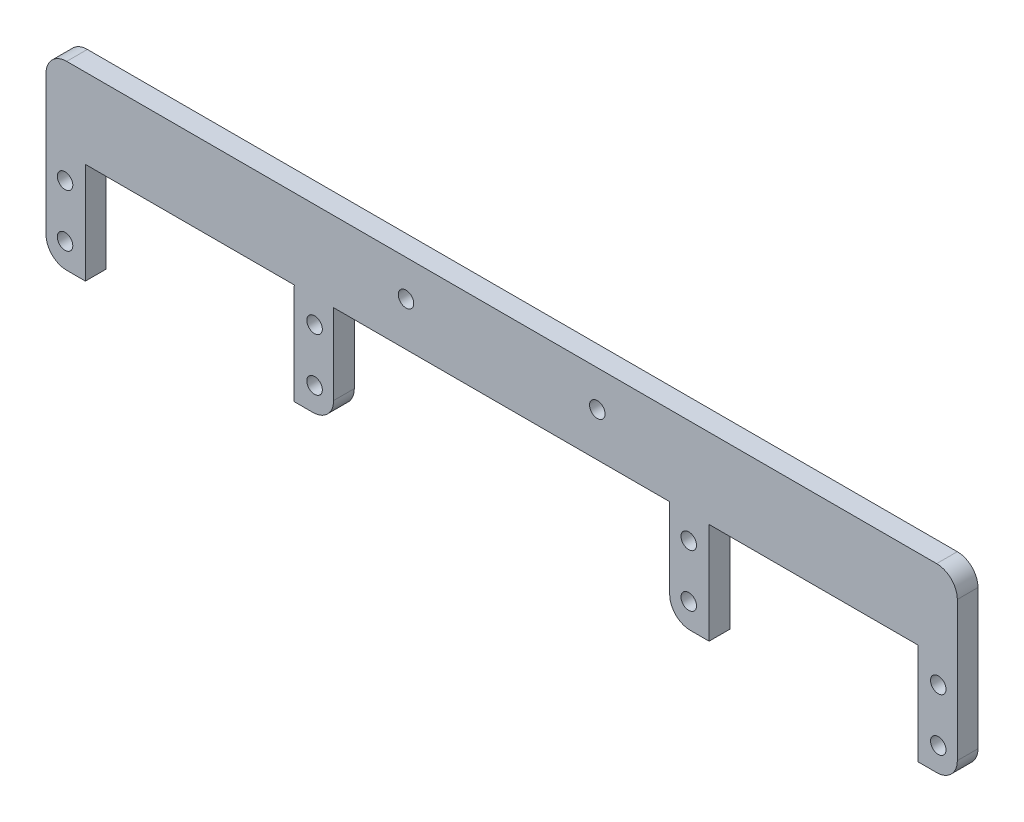
ISO-10303-21;
HEADER;
FILE_DESCRIPTION(('STEP AP214'),'2;1');
FILE_NAME('part.step','',(''),(''),'','','');
FILE_SCHEMA(('AUTOMOTIVE_DESIGN { 1 0 10303 214 1 1 1 1 }'));
ENDSEC;
DATA;
#1=APPLICATION_CONTEXT('core data for automotive mechanical design processes');
#2=APPLICATION_PROTOCOL_DEFINITION('international standard','automotive_design',2000,#1);
#3=PRODUCT_CONTEXT('',#1,'mechanical');
#4=PRODUCT('Part','Part','',(#3));
#5=PRODUCT_RELATED_PRODUCT_CATEGORY('part','',(#4));
#6=PRODUCT_DEFINITION_FORMATION('','',#4);
#7=PRODUCT_DEFINITION_CONTEXT('part definition',#1,'design');
#8=PRODUCT_DEFINITION('design','',#6,#7);
#9=PRODUCT_DEFINITION_SHAPE('','',#8);
#10=(LENGTH_UNIT() NAMED_UNIT(*) SI_UNIT(.MILLI.,.METRE.));
#11=(NAMED_UNIT(*) PLANE_ANGLE_UNIT() SI_UNIT($,.RADIAN.));
#12=(NAMED_UNIT(*) SI_UNIT($,.STERADIAN.) SOLID_ANGLE_UNIT());
#13=UNCERTAINTY_MEASURE_WITH_UNIT(LENGTH_MEASURE(1.E-05),#10,'distance_accuracy_value','');
#14=(GEOMETRIC_REPRESENTATION_CONTEXT(3) GLOBAL_UNCERTAINTY_ASSIGNED_CONTEXT((#13)) GLOBAL_UNIT_ASSIGNED_CONTEXT((#10,
#11,#12)) REPRESENTATION_CONTEXT('',''));
#15=CARTESIAN_POINT('',(0.,0.,0.));
#16=DIRECTION('',(0.,0.,1.));
#17=DIRECTION('',(1.,0.,0.));
#18=AXIS2_PLACEMENT_3D('',#15,#16,#17);
#19=CARTESIAN_POINT('',(0.,32.3655253772291,4.));
#20=DIRECTION('',(0.,1.,0.));
#21=DIRECTION('',(0.,0.,1.));
#22=AXIS2_PLACEMENT_3D('',#19,#20,#21);
#23=PLANE('',#22);
#24=DIRECTION('',(1.,0.,0.));
#25=VECTOR('',#24,1.);
#26=CARTESIAN_POINT('',(0.,32.3655253772291,0.));
#27=LINE('',#26,#25);
#28=CARTESIAN_POINT('',(-211.327093968146,32.3655253772291,0.));
#29=VERTEX_POINT('',#28);
#30=CARTESIAN_POINT('',(-43.0750939681456,32.3655253772291,0.));
#31=VERTEX_POINT('',#30);
#32=EDGE_CURVE('E258',#29,#31,#27,.T.);
#33=ORIENTED_EDGE('',*,*,#32,.F.);
#34=DIRECTION('',(0.,0.,-1.));
#35=VECTOR('',#34,1.);
#36=CARTESIAN_POINT('',(-211.327093968146,32.3655253772291,4.));
#37=LINE('',#36,#35);
#38=CARTESIAN_POINT('',(-211.327093968146,32.3655253772291,4.));
#39=VERTEX_POINT('',#38);
#40=EDGE_CURVE('E11',#29,#39,#37,.F.);
#41=ORIENTED_EDGE('',*,*,#40,.T.);
#42=DIRECTION('',(1.,0.,0.));
#43=VECTOR('',#42,1.);
#44=CARTESIAN_POINT('',(0.,32.3655253772291,4.));
#45=LINE('',#44,#43);
#46=CARTESIAN_POINT('',(-43.0750939681456,32.3655253772291,4.));
#47=VERTEX_POINT('',#46);
#48=EDGE_CURVE('E303',#39,#47,#45,.T.);
#49=ORIENTED_EDGE('',*,*,#48,.T.);
#50=DIRECTION('',(0.,0.,-1.));
#51=VECTOR('',#50,1.);
#52=CARTESIAN_POINT('',(-43.0750939681456,32.3655253772291,0.));
#53=LINE('',#52,#51);
#54=EDGE_CURVE('E42',#47,#31,#53,.T.);
#55=ORIENTED_EDGE('',*,*,#54,.T.);
#56=EDGE_LOOP('',(#33,#41,#49,#55));
#57=FACE_BOUND('',#56,.T.);
#58=ADVANCED_FACE('F34',(#57),#23,.T.);
#59=CARTESIAN_POINT('',(-215.327093968146,0.,4.));
#60=DIRECTION('',(-1.,0.,0.));
#61=DIRECTION('',(0.,0.,1.));
#62=AXIS2_PLACEMENT_3D('',#59,#60,#61);
#63=PLANE('',#62);
#64=DIRECTION('',(0.,1.,0.));
#65=VECTOR('',#64,1.);
#66=CARTESIAN_POINT('',(-215.327093968146,0.,0.));
#67=LINE('',#66,#65);
#68=CARTESIAN_POINT('',(-215.327093968146,1.36552537722908,0.));
#69=VERTEX_POINT('',#68);
#70=CARTESIAN_POINT('',(-215.327093968146,28.3655253772291,0.));
#71=VERTEX_POINT('',#70);
#72=EDGE_CURVE('E261',#69,#71,#67,.T.);
#73=ORIENTED_EDGE('',*,*,#72,.F.);
#74=DIRECTION('',(0.,0.,-1.));
#75=VECTOR('',#74,1.);
#76=CARTESIAN_POINT('',(-215.327093968146,1.36552537722908,4.));
#77=LINE('',#76,#75);
#78=CARTESIAN_POINT('',(-215.327093968146,1.36552537722908,4.));
#79=VERTEX_POINT('',#78);
#80=EDGE_CURVE('E366',#69,#79,#77,.F.);
#81=ORIENTED_EDGE('',*,*,#80,.T.);
#82=DIRECTION('',(0.,1.,0.));
#83=VECTOR('',#82,1.);
#84=CARTESIAN_POINT('',(-215.327093968146,0.,4.));
#85=LINE('',#84,#83);
#86=CARTESIAN_POINT('',(-215.327093968146,28.3655253772291,4.));
#87=VERTEX_POINT('',#86);
#88=EDGE_CURVE('E220',#79,#87,#85,.T.);
#89=ORIENTED_EDGE('',*,*,#88,.T.);
#90=DIRECTION('',(0.,0.,-1.));
#91=VECTOR('',#90,1.);
#92=CARTESIAN_POINT('',(-215.327093968146,28.3655253772291,4.));
#93=LINE('',#92,#91);
#94=EDGE_CURVE('E363',#87,#71,#93,.T.);
#95=ORIENTED_EDGE('',*,*,#94,.T.);
#96=EDGE_LOOP('',(#73,#81,#89,#95));
#97=FACE_BOUND('',#96,.T.);
#98=ADVANCED_FACE('F393',(#97),#63,.T.);
#99=CARTESIAN_POINT('',(0.,-2.63447462277092,4.));
#100=DIRECTION('',(0.,-1.,0.));
#101=DIRECTION('',(0.,0.,-1.));
#102=AXIS2_PLACEMENT_3D('',#99,#100,#101);
#103=PLANE('',#102);
#104=DIRECTION('',(-1.,0.,0.));
#105=VECTOR('',#104,1.);
#106=CARTESIAN_POINT('',(0.,-2.63447462277092,4.));
#107=LINE('',#106,#105);
#108=CARTESIAN_POINT('',(-207.707093968146,-2.63447462277092,4.));
#109=VERTEX_POINT('',#108);
#110=CARTESIAN_POINT('',(-211.327093968146,-2.63447462277092,4.));
#111=VERTEX_POINT('',#110);
#112=EDGE_CURVE('E200',#109,#111,#107,.T.);
#113=ORIENTED_EDGE('',*,*,#112,.T.);
#114=DIRECTION('',(0.,0.,-1.));
#115=VECTOR('',#114,1.);
#116=CARTESIAN_POINT('',(-211.327093968146,-2.63447462277092,4.));
#117=LINE('',#116,#115);
#118=CARTESIAN_POINT('',(-211.327093968146,-2.63447462277092,0.));
#119=VERTEX_POINT('',#118);
#120=EDGE_CURVE('E361',#111,#119,#117,.T.);
#121=ORIENTED_EDGE('',*,*,#120,.T.);
#122=DIRECTION('',(-1.,0.,0.));
#123=VECTOR('',#122,1.);
#124=CARTESIAN_POINT('',(0.,-2.63447462277092,0.));
#125=LINE('',#124,#123);
#126=CARTESIAN_POINT('',(-207.707093968146,-2.63447462277092,0.));
#127=VERTEX_POINT('',#126);
#128=EDGE_CURVE('E203',#127,#119,#125,.T.);
#129=ORIENTED_EDGE('',*,*,#128,.F.);
#130=DIRECTION('',(0.,0.,-1.));
#131=VECTOR('',#130,1.);
#132=CARTESIAN_POINT('',(-207.707093968146,-2.63447462277092,4.));
#133=LINE('',#132,#131);
#134=EDGE_CURVE('E196',#109,#127,#133,.T.);
#135=ORIENTED_EDGE('',*,*,#134,.F.);
#136=EDGE_LOOP('',(#113,#121,#129,#135));
#137=FACE_BOUND('',#136,.T.);
#138=ADVANCED_FACE('F198',(#137),#103,.T.);
#139=CARTESIAN_POINT('',(-207.707093968146,0.,4.));
#140=DIRECTION('',(1.,0.,0.));
#141=DIRECTION('',(0.,0.,-1.));
#142=AXIS2_PLACEMENT_3D('',#139,#140,#141);
#143=PLANE('',#142);
#144=DIRECTION('',(0.,-1.,0.));
#145=VECTOR('',#144,1.);
#146=CARTESIAN_POINT('',(-207.707093968146,0.,0.));
#147=LINE('',#146,#145);
#148=CARTESIAN_POINT('',(-207.707093968146,16.9235253772291,0.));
#149=VERTEX_POINT('',#148);
#150=EDGE_CURVE('E266',#149,#127,#147,.T.);
#151=ORIENTED_EDGE('',*,*,#150,.F.);
#152=DIRECTION('',(0.,0.,-1.));
#153=VECTOR('',#152,1.);
#154=CARTESIAN_POINT('',(-207.707093968146,16.9235253772291,4.));
#155=LINE('',#154,#153);
#156=CARTESIAN_POINT('',(-207.707093968146,16.9235253772291,4.));
#157=VERTEX_POINT('',#156);
#158=EDGE_CURVE('E209',#157,#149,#155,.T.);
#159=ORIENTED_EDGE('',*,*,#158,.F.);
#160=DIRECTION('',(0.,-1.,0.));
#161=VECTOR('',#160,1.);
#162=CARTESIAN_POINT('',(-207.707093968146,0.,4.));
#163=LINE('',#162,#161);
#164=EDGE_CURVE('E215',#157,#109,#163,.T.);
#165=ORIENTED_EDGE('',*,*,#164,.T.);
#166=ORIENTED_EDGE('',*,*,#134,.T.);
#167=EDGE_LOOP('',(#151,#159,#165,#166));
#168=FACE_BOUND('',#167,.T.);
#169=ADVANCED_FACE('F222',(#168),#143,.T.);
#170=CARTESIAN_POINT('',(0.,16.9235253772291,4.));
#171=DIRECTION('',(0.,-1.,0.));
#172=DIRECTION('',(0.,0.,-1.));
#173=AXIS2_PLACEMENT_3D('',#170,#171,#172);
#174=PLANE('',#173);
#175=DIRECTION('',(-1.,0.,0.));
#176=VECTOR('',#175,1.);
#177=CARTESIAN_POINT('',(0.,16.9235253772291,0.));
#178=LINE('',#177,#176);
#179=CARTESIAN_POINT('',(-167.321093968146,16.9235253772291,0.));
#180=VERTEX_POINT('',#179);
#181=EDGE_CURVE('E268',#180,#149,#178,.T.);
#182=ORIENTED_EDGE('',*,*,#181,.F.);
#183=DIRECTION('',(0.,0.,-1.));
#184=VECTOR('',#183,1.);
#185=CARTESIAN_POINT('',(-167.321093968146,16.9235253772291,4.));
#186=LINE('',#185,#184);
#187=CARTESIAN_POINT('',(-167.321093968146,16.9235253772291,4.));
#188=VERTEX_POINT('',#187);
#189=EDGE_CURVE('E327',#188,#180,#186,.T.);
#190=ORIENTED_EDGE('',*,*,#189,.F.);
#191=DIRECTION('',(-1.,0.,0.));
#192=VECTOR('',#191,1.);
#193=CARTESIAN_POINT('',(0.,16.9235253772291,4.));
#194=LINE('',#193,#192);
#195=EDGE_CURVE('E223',#188,#157,#194,.T.);
#196=ORIENTED_EDGE('',*,*,#195,.T.);
#197=ORIENTED_EDGE('',*,*,#158,.T.);
#198=EDGE_LOOP('',(#182,#190,#196,#197));
#199=FACE_BOUND('',#198,.T.);
#200=ADVANCED_FACE('F827',(#199),#174,.T.);
#201=CARTESIAN_POINT('',(-129.794494110069,-61.8400685254336,4.));
#202=DIRECTION('',(0.9027709537187,0.430121616664205,0.));
#203=DIRECTION('',(-0.430121616664205,0.9027709537187,0.));
#204=AXIS2_PLACEMENT_3D('',#201,#202,#203);
#205=PLANE('',#204);
#206=DIRECTION('',(0.430121616664205,-0.9027709537187,0.));
#207=VECTOR('',#206,1.);
#208=CARTESIAN_POINT('',(-129.794494110069,-61.8400685254336,0.));
#209=LINE('',#208,#207);
#210=CARTESIAN_POINT('',(-167.231910297222,16.7363401148836,0.));
#211=VERTEX_POINT('',#210);
#212=EDGE_CURVE('E271',#180,#211,#209,.T.);
#213=ORIENTED_EDGE('',*,*,#212,.T.);
#214=DIRECTION('',(0.,0.,-1.));
#215=VECTOR('',#214,1.);
#216=CARTESIAN_POINT('',(-167.231910297222,16.7363401148836,4.));
#217=LINE('',#216,#215);
#218=CARTESIAN_POINT('',(-167.231910297222,16.7363401148836,4.));
#219=VERTEX_POINT('',#218);
#220=EDGE_CURVE('E325',#219,#211,#217,.T.);
#221=ORIENTED_EDGE('',*,*,#220,.F.);
#222=DIRECTION('',(0.430121616664205,-0.9027709537187,0.));
#223=VECTOR('',#222,1.);
#224=CARTESIAN_POINT('',(-129.794494110069,-61.8400685254336,4.));
#225=LINE('',#224,#223);
#226=EDGE_CURVE('E225',#188,#219,#225,.T.);
#227=ORIENTED_EDGE('',*,*,#226,.F.);
#228=ORIENTED_EDGE('',*,*,#189,.T.);
#229=EDGE_LOOP('',(#213,#221,#227,#228));
#230=FACE_BOUND('',#229,.T.);
#231=ADVANCED_FACE('F817',(#230),#205,.F.);
#232=CARTESIAN_POINT('',(0.0738221222793477,15.9626026151486,4.));
#233=DIRECTION('',(0.00462464264921358,0.999989306283006,0.));
#234=DIRECTION('',(-0.999989306283006,0.00462464264921358,0.));
#235=AXIS2_PLACEMENT_3D('',#232,#233,#234);
#236=PLANE('',#235);
#237=DIRECTION('',(0.999989306283006,-0.00462464264921357,0.));
#238=VECTOR('',#237,1.);
#239=CARTESIAN_POINT('',(0.0738221222793477,15.9626026151486,0.));
#240=LINE('',#239,#238);
#241=CARTESIAN_POINT('',(-167.321093968146,16.7367525619023,0.));
#242=VERTEX_POINT('',#241);
#243=EDGE_CURVE('E274',#242,#211,#240,.T.);
#244=ORIENTED_EDGE('',*,*,#243,.F.);
#245=DIRECTION('',(0.,0.,-1.));
#246=VECTOR('',#245,1.);
#247=CARTESIAN_POINT('',(-167.321093968146,16.7367525619023,4.));
#248=LINE('',#247,#246);
#249=CARTESIAN_POINT('',(-167.321093968146,16.7367525619023,4.));
#250=VERTEX_POINT('',#249);
#251=EDGE_CURVE('E323',#250,#242,#248,.T.);
#252=ORIENTED_EDGE('',*,*,#251,.F.);
#253=DIRECTION('',(0.999989306283006,-0.00462464264921357,0.));
#254=VECTOR('',#253,1.);
#255=CARTESIAN_POINT('',(0.0738221222793477,15.9626026151486,4.));
#256=LINE('',#255,#254);
#257=EDGE_CURVE('E230',#250,#219,#256,.T.);
#258=ORIENTED_EDGE('',*,*,#257,.T.);
#259=ORIENTED_EDGE('',*,*,#220,.T.);
#260=EDGE_LOOP('',(#244,#252,#258,#259));
#261=FACE_BOUND('',#260,.T.);
#262=ADVANCED_FACE('F807',(#261),#236,.T.);
#263=CARTESIAN_POINT('',(-167.321093968146,0.,4.));
#264=DIRECTION('',(-1.,0.,0.));
#265=DIRECTION('',(0.,0.,1.));
#266=AXIS2_PLACEMENT_3D('',#263,#264,#265);
#267=PLANE('',#266);
#268=DIRECTION('',(0.,1.,0.));
#269=VECTOR('',#268,1.);
#270=CARTESIAN_POINT('',(-167.321093968146,0.,0.));
#271=LINE('',#270,#269);
#272=CARTESIAN_POINT('',(-167.321093968146,-2.63447462277092,0.));
#273=VERTEX_POINT('',#272);
#274=EDGE_CURVE('E277',#273,#242,#271,.T.);
#275=ORIENTED_EDGE('',*,*,#274,.F.);
#276=DIRECTION('',(0.,0.,-1.));
#277=VECTOR('',#276,1.);
#278=CARTESIAN_POINT('',(-167.321093968146,-2.63447462277092,4.));
#279=LINE('',#278,#277);
#280=CARTESIAN_POINT('',(-167.321093968146,-2.63447462277092,4.));
#281=VERTEX_POINT('',#280);
#282=EDGE_CURVE('E320',#281,#273,#279,.T.);
#283=ORIENTED_EDGE('',*,*,#282,.F.);
#284=DIRECTION('',(0.,1.,0.));
#285=VECTOR('',#284,1.);
#286=CARTESIAN_POINT('',(-167.321093968146,0.,4.));
#287=LINE('',#286,#285);
#288=EDGE_CURVE('E233',#281,#250,#287,.T.);
#289=ORIENTED_EDGE('',*,*,#288,.T.);
#290=ORIENTED_EDGE('',*,*,#251,.T.);
#291=EDGE_LOOP('',(#275,#283,#289,#290));
#292=FACE_BOUND('',#291,.T.);
#293=ADVANCED_FACE('F746',(#292),#267,.T.);
#294=CARTESIAN_POINT('',(0.,-2.63447462277092,4.));
#295=DIRECTION('',(0.,-1.,0.));
#296=DIRECTION('',(0.,0.,-1.));
#297=AXIS2_PLACEMENT_3D('',#294,#295,#296);
#298=PLANE('',#297);
#299=DIRECTION('',(-1.,0.,0.));
#300=VECTOR('',#299,1.);
#301=CARTESIAN_POINT('',(0.,-2.63447462277092,0.));
#302=LINE('',#301,#300);
#303=CARTESIAN_POINT('',(-163.701093968146,-2.63447462277092,0.));
#304=VERTEX_POINT('',#303);
#305=EDGE_CURVE('E280',#304,#273,#302,.T.);
#306=ORIENTED_EDGE('',*,*,#305,.F.);
#307=DIRECTION('',(0.,0.,-1.));
#308=VECTOR('',#307,1.);
#309=CARTESIAN_POINT('',(-163.701093968146,-2.63447462277092,4.));
#310=LINE('',#309,#308);
#311=CARTESIAN_POINT('',(-163.701093968146,-2.63447462277092,4.));
#312=VERTEX_POINT('',#311);
#313=EDGE_CURVE('E359',#304,#312,#310,.F.);
#314=ORIENTED_EDGE('',*,*,#313,.T.);
#315=DIRECTION('',(-1.,0.,0.));
#316=VECTOR('',#315,1.);
#317=CARTESIAN_POINT('',(0.,-2.63447462277092,4.));
#318=LINE('',#317,#316);
#319=EDGE_CURVE('E236',#312,#281,#318,.T.);
#320=ORIENTED_EDGE('',*,*,#319,.T.);
#321=ORIENTED_EDGE('',*,*,#282,.T.);
#322=EDGE_LOOP('',(#306,#314,#320,#321));
#323=FACE_BOUND('',#322,.T.);
#324=ADVANCED_FACE('F736',(#323),#298,.T.);
#325=CARTESIAN_POINT('',(-159.701093968146,0.,4.));
#326=DIRECTION('',(1.,0.,0.));
#327=DIRECTION('',(0.,0.,-1.));
#328=AXIS2_PLACEMENT_3D('',#325,#326,#327);
#329=PLANE('',#328);
#330=DIRECTION('',(0.,-1.,0.));
#331=VECTOR('',#330,1.);
#332=CARTESIAN_POINT('',(-159.701093968146,0.,4.));
#333=LINE('',#332,#331);
#334=CARTESIAN_POINT('',(-159.701093968146,16.9235253772291,4.));
#335=VERTEX_POINT('',#334);
#336=CARTESIAN_POINT('',(-159.701093968146,1.36552537722908,4.));
#337=VERTEX_POINT('',#336);
#338=EDGE_CURVE('E238',#335,#337,#333,.T.);
#339=ORIENTED_EDGE('',*,*,#338,.T.);
#340=DIRECTION('',(0.,0.,-1.));
#341=VECTOR('',#340,1.);
#342=CARTESIAN_POINT('',(-159.701093968146,1.36552537722908,4.));
#343=LINE('',#342,#341);
#344=CARTESIAN_POINT('',(-159.701093968146,1.36552537722908,0.));
#345=VERTEX_POINT('',#344);
#346=EDGE_CURVE('E356',#337,#345,#343,.T.);
#347=ORIENTED_EDGE('',*,*,#346,.T.);
#348=DIRECTION('',(0.,-1.,0.));
#349=VECTOR('',#348,1.);
#350=CARTESIAN_POINT('',(-159.701093968146,0.,0.));
#351=LINE('',#350,#349);
#352=CARTESIAN_POINT('',(-159.701093968146,16.9235253772291,0.));
#353=VERTEX_POINT('',#352);
#354=EDGE_CURVE('E282',#353,#345,#351,.T.);
#355=ORIENTED_EDGE('',*,*,#354,.F.);
#356=DIRECTION('',(0.,0.,-1.));
#357=VECTOR('',#356,1.);
#358=CARTESIAN_POINT('',(-159.701093968146,16.9235253772291,4.));
#359=LINE('',#358,#357);
#360=EDGE_CURVE('E318',#335,#353,#359,.T.);
#361=ORIENTED_EDGE('',*,*,#360,.F.);
#362=EDGE_LOOP('',(#339,#347,#355,#361));
#363=FACE_BOUND('',#362,.T.);
#364=ADVANCED_FACE('F731',(#363),#329,.T.);
#365=CARTESIAN_POINT('',(0.,16.9235253772291,4.));
#366=DIRECTION('',(0.,1.,0.));
#367=DIRECTION('',(0.,0.,1.));
#368=AXIS2_PLACEMENT_3D('',#365,#366,#367);
#369=PLANE('',#368);
#370=DIRECTION('',(1.,0.,0.));
#371=VECTOR('',#370,1.);
#372=CARTESIAN_POINT('',(0.,16.9235253772291,0.));
#373=LINE('',#372,#371);
#374=CARTESIAN_POINT('',(-94.7010939681456,16.9235253772291,0.));
#375=VERTEX_POINT('',#374);
#376=EDGE_CURVE('E285',#353,#375,#373,.T.);
#377=ORIENTED_EDGE('',*,*,#376,.T.);
#378=DIRECTION('',(0.,0.,-1.));
#379=VECTOR('',#378,1.);
#380=CARTESIAN_POINT('',(-94.7010939681456,16.9235253772291,4.));
#381=LINE('',#380,#379);
#382=CARTESIAN_POINT('',(-94.7010939681456,16.9235253772291,4.));
#383=VERTEX_POINT('',#382);
#384=EDGE_CURVE('E315',#383,#375,#381,.T.);
#385=ORIENTED_EDGE('',*,*,#384,.F.);
#386=DIRECTION('',(1.,0.,0.));
#387=VECTOR('',#386,1.);
#388=CARTESIAN_POINT('',(0.,16.9235253772291,4.));
#389=LINE('',#388,#387);
#390=EDGE_CURVE('E241',#335,#383,#389,.T.);
#391=ORIENTED_EDGE('',*,*,#390,.F.);
#392=ORIENTED_EDGE('',*,*,#360,.T.);
#393=EDGE_LOOP('',(#377,#385,#391,#392));
#394=FACE_BOUND('',#393,.T.);
#395=ADVANCED_FACE('F723',(#394),#369,.F.);
#396=CARTESIAN_POINT('',(-94.7010939681456,0.,4.));
#397=DIRECTION('',(1.,0.,0.));
#398=DIRECTION('',(0.,0.,-1.));
#399=AXIS2_PLACEMENT_3D('',#396,#397,#398);
#400=PLANE('',#399);
#401=DIRECTION('',(0.,-1.,0.));
#402=VECTOR('',#401,1.);
#403=CARTESIAN_POINT('',(-94.7010939681456,0.,0.));
#404=LINE('',#403,#402);
#405=CARTESIAN_POINT('',(-94.7010939681456,1.36552537722908,0.));
#406=VERTEX_POINT('',#405);
#407=EDGE_CURVE('E287',#375,#406,#404,.T.);
#408=ORIENTED_EDGE('',*,*,#407,.T.);
#409=DIRECTION('',(0.,0.,-1.));
#410=VECTOR('',#409,1.);
#411=CARTESIAN_POINT('',(-94.7010939681456,1.36552537722908,4.));
#412=LINE('',#411,#410);
#413=CARTESIAN_POINT('',(-94.7010939681456,1.36552537722908,4.));
#414=VERTEX_POINT('',#413);
#415=EDGE_CURVE('E344',#406,#414,#412,.F.);
#416=ORIENTED_EDGE('',*,*,#415,.T.);
#417=DIRECTION('',(0.,-1.,0.));
#418=VECTOR('',#417,1.);
#419=CARTESIAN_POINT('',(-94.7010939681456,0.,4.));
#420=LINE('',#419,#418);
#421=EDGE_CURVE('E243',#383,#414,#420,.T.);
#422=ORIENTED_EDGE('',*,*,#421,.F.);
#423=ORIENTED_EDGE('',*,*,#384,.T.);
#424=EDGE_LOOP('',(#408,#416,#422,#423));
#425=FACE_BOUND('',#424,.T.);
#426=ADVANCED_FACE('F711',(#425),#400,.F.);
#427=CARTESIAN_POINT('',(0.,-2.63447462277092,4.));
#428=DIRECTION('',(0.,1.,0.));
#429=DIRECTION('',(0.,0.,1.));
#430=AXIS2_PLACEMENT_3D('',#427,#428,#429);
#431=PLANE('',#430);
#432=DIRECTION('',(1.,0.,0.));
#433=VECTOR('',#432,1.);
#434=CARTESIAN_POINT('',(0.,-2.63447462277092,4.));
#435=LINE('',#434,#433);
#436=CARTESIAN_POINT('',(-90.7010939681456,-2.63447462277092,4.));
#437=VERTEX_POINT('',#436);
#438=CARTESIAN_POINT('',(-87.0810939681456,-2.63447462277092,4.));
#439=VERTEX_POINT('',#438);
#440=EDGE_CURVE('E245',#437,#439,#435,.T.);
#441=ORIENTED_EDGE('',*,*,#440,.F.);
#442=DIRECTION('',(0.,0.,-1.));
#443=VECTOR('',#442,1.);
#444=CARTESIAN_POINT('',(-90.7010939681456,-2.63447462277092,4.));
#445=LINE('',#444,#443);
#446=CARTESIAN_POINT('',(-90.7010939681456,-2.63447462277092,0.));
#447=VERTEX_POINT('',#446);
#448=EDGE_CURVE('E208',#437,#447,#445,.T.);
#449=ORIENTED_EDGE('',*,*,#448,.T.);
#450=DIRECTION('',(1.,0.,0.));
#451=VECTOR('',#450,1.);
#452=CARTESIAN_POINT('',(0.,-2.63447462277092,0.));
#453=LINE('',#452,#451);
#454=CARTESIAN_POINT('',(-87.0810939681456,-2.63447462277092,0.));
#455=VERTEX_POINT('',#454);
#456=EDGE_CURVE('E290',#447,#455,#453,.T.);
#457=ORIENTED_EDGE('',*,*,#456,.T.);
#458=DIRECTION('',(0.,0.,-1.));
#459=VECTOR('',#458,1.);
#460=CARTESIAN_POINT('',(-87.0810939681456,-2.63447462277092,4.));
#461=LINE('',#460,#459);
#462=EDGE_CURVE('E312',#439,#455,#461,.T.);
#463=ORIENTED_EDGE('',*,*,#462,.F.);
#464=EDGE_LOOP('',(#441,#449,#457,#463));
#465=FACE_BOUND('',#464,.T.);
#466=ADVANCED_FACE('F705',(#465),#431,.F.);
#467=CARTESIAN_POINT('',(-87.0810939681456,0.,4.));
#468=DIRECTION('',(-1.,0.,0.));
#469=DIRECTION('',(0.,0.,1.));
#470=AXIS2_PLACEMENT_3D('',#467,#468,#469);
#471=PLANE('',#470);
#472=DIRECTION('',(0.,1.,0.));
#473=VECTOR('',#472,1.);
#474=CARTESIAN_POINT('',(-87.0810939681456,0.,0.));
#475=LINE('',#474,#473);
#476=CARTESIAN_POINT('',(-87.0810939681456,16.9235253772291,0.));
#477=VERTEX_POINT('',#476);
#478=EDGE_CURVE('E292',#455,#477,#475,.T.);
#479=ORIENTED_EDGE('',*,*,#478,.T.);
#480=DIRECTION('',(0.,0.,-1.));
#481=VECTOR('',#480,1.);
#482=CARTESIAN_POINT('',(-87.0810939681456,16.9235253772291,4.));
#483=LINE('',#482,#481);
#484=CARTESIAN_POINT('',(-87.0810939681456,16.9235253772291,4.));
#485=VERTEX_POINT('',#484);
#486=EDGE_CURVE('E309',#485,#477,#483,.T.);
#487=ORIENTED_EDGE('',*,*,#486,.F.);
#488=DIRECTION('',(0.,1.,0.));
#489=VECTOR('',#488,1.);
#490=CARTESIAN_POINT('',(-87.0810939681456,0.,4.));
#491=LINE('',#490,#489);
#492=EDGE_CURVE('E247',#439,#485,#491,.T.);
#493=ORIENTED_EDGE('',*,*,#492,.F.);
#494=ORIENTED_EDGE('',*,*,#462,.T.);
#495=EDGE_LOOP('',(#479,#487,#493,#494));
#496=FACE_BOUND('',#495,.T.);
#497=ADVANCED_FACE('F710',(#496),#471,.F.);
#498=CARTESIAN_POINT('',(0.,16.9235253772291,4.));
#499=DIRECTION('',(0.,1.,0.));
#500=DIRECTION('',(0.,0.,1.));
#501=AXIS2_PLACEMENT_3D('',#498,#499,#500);
#502=PLANE('',#501);
#503=DIRECTION('',(1.,0.,0.));
#504=VECTOR('',#503,1.);
#505=CARTESIAN_POINT('',(0.,16.9235253772291,0.));
#506=LINE('',#505,#504);
#507=CARTESIAN_POINT('',(-46.6950939681456,16.9235253772291,0.));
#508=VERTEX_POINT('',#507);
#509=EDGE_CURVE('E294',#477,#508,#506,.T.);
#510=ORIENTED_EDGE('',*,*,#509,.T.);
#511=DIRECTION('',(0.,0.,-1.));
#512=VECTOR('',#511,1.);
#513=CARTESIAN_POINT('',(-46.6950939681456,16.9235253772291,4.));
#514=LINE('',#513,#512);
#515=CARTESIAN_POINT('',(-46.6950939681456,16.9235253772291,4.));
#516=VERTEX_POINT('',#515);
#517=EDGE_CURVE('E306',#516,#508,#514,.T.);
#518=ORIENTED_EDGE('',*,*,#517,.F.);
#519=DIRECTION('',(1.,0.,0.));
#520=VECTOR('',#519,1.);
#521=CARTESIAN_POINT('',(0.,16.9235253772291,4.));
#522=LINE('',#521,#520);
#523=EDGE_CURVE('E249',#485,#516,#522,.T.);
#524=ORIENTED_EDGE('',*,*,#523,.F.);
#525=ORIENTED_EDGE('',*,*,#486,.T.);
#526=EDGE_LOOP('',(#510,#518,#524,#525));
#527=FACE_BOUND('',#526,.T.);
#528=ADVANCED_FACE('F776',(#527),#502,.F.);
#529=CARTESIAN_POINT('',(-46.6950939681456,0.,4.));
#530=DIRECTION('',(1.,0.,0.));
#531=DIRECTION('',(0.,0.,-1.));
#532=AXIS2_PLACEMENT_3D('',#529,#530,#531);
#533=PLANE('',#532);
#534=DIRECTION('',(0.,-1.,0.));
#535=VECTOR('',#534,1.);
#536=CARTESIAN_POINT('',(-46.6950939681456,0.,0.));
#537=LINE('',#536,#535);
#538=CARTESIAN_POINT('',(-46.6950939681456,-2.63447462277092,0.));
#539=VERTEX_POINT('',#538);
#540=EDGE_CURVE('E296',#508,#539,#537,.T.);
#541=ORIENTED_EDGE('',*,*,#540,.T.);
#542=DIRECTION('',(0.,0.,-1.));
#543=VECTOR('',#542,1.);
#544=CARTESIAN_POINT('',(-46.6950939681456,-2.63447462277092,4.));
#545=LINE('',#544,#543);
#546=CARTESIAN_POINT('',(-46.6950939681456,-2.63447462277092,4.));
#547=VERTEX_POINT('',#546);
#548=EDGE_CURVE('E257',#547,#539,#545,.T.);
#549=ORIENTED_EDGE('',*,*,#548,.F.);
#550=DIRECTION('',(0.,-1.,0.));
#551=VECTOR('',#550,1.);
#552=CARTESIAN_POINT('',(-46.6950939681456,0.,4.));
#553=LINE('',#552,#551);
#554=EDGE_CURVE('E251',#516,#547,#553,.T.);
#555=ORIENTED_EDGE('',*,*,#554,.F.);
#556=ORIENTED_EDGE('',*,*,#517,.T.);
#557=EDGE_LOOP('',(#541,#549,#555,#556));
#558=FACE_BOUND('',#557,.T.);
#559=ADVANCED_FACE('F697',(#558),#533,.F.);
#560=CARTESIAN_POINT('',(0.,-2.63447462277092,4.));
#561=DIRECTION('',(0.,1.,0.));
#562=DIRECTION('',(0.,0.,1.));
#563=AXIS2_PLACEMENT_3D('',#560,#561,#562);
#564=PLANE('',#563);
#565=DIRECTION('',(1.,0.,0.));
#566=VECTOR('',#565,1.);
#567=CARTESIAN_POINT('',(0.,-2.63447462277092,0.));
#568=LINE('',#567,#566);
#569=CARTESIAN_POINT('',(-43.0750939681456,-2.63447462277092,0.));
#570=VERTEX_POINT('',#569);
#571=EDGE_CURVE('E298',#539,#570,#568,.T.);
#572=ORIENTED_EDGE('',*,*,#571,.T.);
#573=DIRECTION('',(0.,0.,-1.));
#574=VECTOR('',#573,1.);
#575=CARTESIAN_POINT('',(-43.0750939681456,-2.63447462277092,4.));
#576=LINE('',#575,#574);
#577=CARTESIAN_POINT('',(-43.0750939681456,-2.63447462277092,4.));
#578=VERTEX_POINT('',#577);
#579=EDGE_CURVE('E372',#570,#578,#576,.F.);
#580=ORIENTED_EDGE('',*,*,#579,.T.);
#581=DIRECTION('',(1.,0.,0.));
#582=VECTOR('',#581,1.);
#583=CARTESIAN_POINT('',(0.,-2.63447462277092,4.));
#584=LINE('',#583,#582);
#585=EDGE_CURVE('E253',#547,#578,#584,.T.);
#586=ORIENTED_EDGE('',*,*,#585,.F.);
#587=ORIENTED_EDGE('',*,*,#548,.T.);
#588=EDGE_LOOP('',(#572,#580,#586,#587));
#589=FACE_BOUND('',#588,.T.);
#590=ADVANCED_FACE('F688',(#589),#564,.F.);
#591=CARTESIAN_POINT('',(-39.0750939681456,0.,4.));
#592=DIRECTION('',(-1.,0.,0.));
#593=DIRECTION('',(0.,0.,1.));
#594=AXIS2_PLACEMENT_3D('',#591,#592,#593);
#595=PLANE('',#594);
#596=DIRECTION('',(0.,1.,0.));
#597=VECTOR('',#596,1.);
#598=CARTESIAN_POINT('',(-39.0750939681456,0.,4.));
#599=LINE('',#598,#597);
#600=CARTESIAN_POINT('',(-39.0750939681456,1.36552537722908,4.));
#601=VERTEX_POINT('',#600);
#602=CARTESIAN_POINT('',(-39.0750939681456,28.3655253772291,4.));
#603=VERTEX_POINT('',#602);
#604=EDGE_CURVE('E255',#601,#603,#599,.T.);
#605=ORIENTED_EDGE('',*,*,#604,.F.);
#606=DIRECTION('',(0.,0.,-1.));
#607=VECTOR('',#606,1.);
#608=CARTESIAN_POINT('',(-39.0750939681456,1.36552537722908,4.));
#609=LINE('',#608,#607);
#610=CARTESIAN_POINT('',(-39.0750939681456,1.36552537722908,0.));
#611=VERTEX_POINT('',#610);
#612=EDGE_CURVE('E369',#601,#611,#609,.T.);
#613=ORIENTED_EDGE('',*,*,#612,.T.);
#614=DIRECTION('',(0.,1.,0.));
#615=VECTOR('',#614,1.);
#616=CARTESIAN_POINT('',(-39.0750939681456,0.,0.));
#617=LINE('',#616,#615);
#618=CARTESIAN_POINT('',(-39.0750939681456,28.3655253772291,0.));
#619=VERTEX_POINT('',#618);
#620=EDGE_CURVE('E301',#611,#619,#617,.T.);
#621=ORIENTED_EDGE('',*,*,#620,.T.);
#622=DIRECTION('',(0.,0.,-1.));
#623=VECTOR('',#622,1.);
#624=CARTESIAN_POINT('',(-39.0750939681456,28.3655253772291,4.));
#625=LINE('',#624,#623);
#626=EDGE_CURVE('E49',#619,#603,#625,.F.);
#627=ORIENTED_EDGE('',*,*,#626,.T.);
#628=EDGE_LOOP('',(#605,#613,#621,#627));
#629=FACE_BOUND('',#628,.T.);
#630=ADVANCED_FACE('F461',(#629),#595,.F.);
#631=CARTESIAN_POINT('',(0.,0.,4.));
#632=DIRECTION('',(0.,0.,1.));
#633=DIRECTION('',(1.,0.,0.));
#634=AXIS2_PLACEMENT_3D('',#631,#632,#633);
#635=PLANE('',#634);
#636=CARTESIAN_POINT('',(-108.701093968146,25.3655253772291,4.));
#637=DIRECTION('',(0.,0.,1.));
#638=DIRECTION('',(1.,0.,0.));
#639=AXIS2_PLACEMENT_3D('',#636,#637,#638);
#640=CIRCLE('',#639,1.5);
#641=CARTESIAN_POINT('',(-107.201093968146,25.3655253772291,4.));
#642=VERTEX_POINT('',#641);
#643=EDGE_CURVE('E448',#642,#642,#640,.T.);
#644=ORIENTED_EDGE('',*,*,#643,.F.);
#645=EDGE_LOOP('',(#644));
#646=FACE_BOUND('',#645,.T.);
#647=CARTESIAN_POINT('',(-145.701093968146,25.3655253772291,4.));
#648=DIRECTION('',(0.,0.,1.));
#649=DIRECTION('',(1.,0.,0.));
#650=AXIS2_PLACEMENT_3D('',#647,#648,#649);
#651=CIRCLE('',#650,1.5);
#652=CARTESIAN_POINT('',(-144.201093968146,25.3655253772291,4.));
#653=VERTEX_POINT('',#652);
#654=EDGE_CURVE('E445',#653,#653,#651,.T.);
#655=ORIENTED_EDGE('',*,*,#654,.F.);
#656=EDGE_LOOP('',(#655));
#657=FACE_BOUND('',#656,.T.);
#658=CARTESIAN_POINT('',(-91.0180939681455,2.06452537722908,4.));
#659=DIRECTION('',(0.,0.,1.));
#660=DIRECTION('',(1.,0.,0.));
#661=AXIS2_PLACEMENT_3D('',#658,#659,#660);
#662=CIRCLE('',#661,1.5);
#663=CARTESIAN_POINT('',(-89.5180939681455,2.06452537722908,4.));
#664=VERTEX_POINT('',#663);
#665=EDGE_CURVE('E439',#664,#664,#662,.T.);
#666=ORIENTED_EDGE('',*,*,#665,.F.);
#667=EDGE_LOOP('',(#666));
#668=FACE_BOUND('',#667,.T.);
#669=CARTESIAN_POINT('',(-42.7580939681455,2.06452537722908,4.));
#670=DIRECTION('',(0.,0.,1.));
#671=DIRECTION('',(1.,0.,0.));
#672=AXIS2_PLACEMENT_3D('',#669,#670,#671);
#673=CIRCLE('',#672,1.5);
#674=CARTESIAN_POINT('',(-41.2580939681455,2.06452537722908,4.));
#675=VERTEX_POINT('',#674);
#676=EDGE_CURVE('E433',#675,#675,#673,.T.);
#677=ORIENTED_EDGE('',*,*,#676,.F.);
#678=EDGE_LOOP('',(#677));
#679=FACE_BOUND('',#678,.T.);
#680=CARTESIAN_POINT('',(-42.7580939681456,12.2245253772291,4.));
#681=DIRECTION('',(0.,0.,1.));
#682=DIRECTION('',(1.,0.,0.));
#683=AXIS2_PLACEMENT_3D('',#680,#681,#682);
#684=CIRCLE('',#683,1.5);
#685=CARTESIAN_POINT('',(-41.2580939681456,12.2245253772291,4.));
#686=VERTEX_POINT('',#685);
#687=EDGE_CURVE('E427',#686,#686,#684,.T.);
#688=ORIENTED_EDGE('',*,*,#687,.F.);
#689=EDGE_LOOP('',(#688));
#690=FACE_BOUND('',#689,.T.);
#691=CARTESIAN_POINT('',(-211.644093968146,2.06452537722908,4.));
#692=DIRECTION('',(0.,0.,1.));
#693=DIRECTION('',(1.,0.,0.));
#694=AXIS2_PLACEMENT_3D('',#691,#692,#693);
#695=CIRCLE('',#694,1.5);
#696=CARTESIAN_POINT('',(-210.144093968146,2.06452537722908,4.));
#697=VERTEX_POINT('',#696);
#698=EDGE_CURVE('E421',#697,#697,#695,.T.);
#699=ORIENTED_EDGE('',*,*,#698,.F.);
#700=EDGE_LOOP('',(#699));
#701=FACE_BOUND('',#700,.T.);
#702=CARTESIAN_POINT('',(-163.384093968146,2.06452537722908,4.));
#703=DIRECTION('',(0.,0.,1.));
#704=DIRECTION('',(1.,0.,0.));
#705=AXIS2_PLACEMENT_3D('',#702,#703,#704);
#706=CIRCLE('',#705,1.5);
#707=CARTESIAN_POINT('',(-161.884093968146,2.06452537722908,4.));
#708=VERTEX_POINT('',#707);
#709=EDGE_CURVE('E415',#708,#708,#706,.T.);
#710=ORIENTED_EDGE('',*,*,#709,.F.);
#711=EDGE_LOOP('',(#710));
#712=FACE_BOUND('',#711,.T.);
#713=CARTESIAN_POINT('',(-163.384093968146,12.2245253772291,4.));
#714=DIRECTION('',(0.,0.,1.));
#715=DIRECTION('',(1.,0.,0.));
#716=AXIS2_PLACEMENT_3D('',#713,#714,#715);
#717=CIRCLE('',#716,1.5);
#718=CARTESIAN_POINT('',(-161.884093968146,12.2245253772291,4.));
#719=VERTEX_POINT('',#718);
#720=EDGE_CURVE('E409',#719,#719,#717,.T.);
#721=ORIENTED_EDGE('',*,*,#720,.F.);
#722=EDGE_LOOP('',(#721));
#723=FACE_BOUND('',#722,.T.);
#724=CARTESIAN_POINT('',(-91.0180939681456,12.2245253772291,4.));
#725=DIRECTION('',(0.,0.,1.));
#726=DIRECTION('',(1.,0.,0.));
#727=AXIS2_PLACEMENT_3D('',#724,#725,#726);
#728=CIRCLE('',#727,1.5);
#729=CARTESIAN_POINT('',(-89.5180939681456,12.2245253772291,4.));
#730=VERTEX_POINT('',#729);
#731=EDGE_CURVE('E403',#730,#730,#728,.T.);
#732=ORIENTED_EDGE('',*,*,#731,.F.);
#733=EDGE_LOOP('',(#732));
#734=FACE_BOUND('',#733,.T.);
#735=CARTESIAN_POINT('',(-211.644093968146,12.2245253772291,4.));
#736=DIRECTION('',(0.,0.,1.));
#737=DIRECTION('',(1.,0.,0.));
#738=AXIS2_PLACEMENT_3D('',#735,#736,#737);
#739=CIRCLE('',#738,1.5);
#740=CARTESIAN_POINT('',(-210.144093968146,12.2245253772291,4.));
#741=VERTEX_POINT('',#740);
#742=EDGE_CURVE('E397',#741,#741,#739,.T.);
#743=ORIENTED_EDGE('',*,*,#742,.F.);
#744=EDGE_LOOP('',(#743));
#745=FACE_BOUND('',#744,.T.);
#746=ORIENTED_EDGE('',*,*,#421,.T.);
#747=CARTESIAN_POINT('',(-90.7010939681456,1.36552537722908,4.));
#748=DIRECTION('',(0.,0.,1.));
#749=DIRECTION('',(1.,0.,0.));
#750=AXIS2_PLACEMENT_3D('',#747,#748,#749);
#751=CIRCLE('',#750,4.);
#752=EDGE_CURVE('E354',#414,#437,#751,.T.);
#753=ORIENTED_EDGE('',*,*,#752,.T.);
#754=ORIENTED_EDGE('',*,*,#440,.T.);
#755=ORIENTED_EDGE('',*,*,#492,.T.);
#756=ORIENTED_EDGE('',*,*,#523,.T.);
#757=ORIENTED_EDGE('',*,*,#554,.T.);
#758=ORIENTED_EDGE('',*,*,#585,.T.);
#759=CARTESIAN_POINT('',(-43.0750939681456,1.36552537722908,4.));
#760=DIRECTION('',(0.,0.,1.));
#761=DIRECTION('',(1.,0.,0.));
#762=AXIS2_PLACEMENT_3D('',#759,#760,#761);
#763=CIRCLE('',#762,4.);
#764=EDGE_CURVE('E56',#578,#601,#763,.T.);
#765=ORIENTED_EDGE('',*,*,#764,.T.);
#766=ORIENTED_EDGE('',*,*,#604,.T.);
#767=CARTESIAN_POINT('',(-43.0750939681456,28.3655253772291,4.));
#768=DIRECTION('',(0.,0.,1.));
#769=DIRECTION('',(1.,0.,0.));
#770=AXIS2_PLACEMENT_3D('',#767,#768,#769);
#771=CIRCLE('',#770,4.);
#772=EDGE_CURVE('E346',#603,#47,#771,.T.);
#773=ORIENTED_EDGE('',*,*,#772,.T.);
#774=ORIENTED_EDGE('',*,*,#48,.F.);
#775=CARTESIAN_POINT('',(-211.327093968146,28.3655253772291,4.));
#776=DIRECTION('',(0.,0.,1.));
#777=DIRECTION('',(1.,0.,0.));
#778=AXIS2_PLACEMENT_3D('',#775,#776,#777);
#779=CIRCLE('',#778,4.);
#780=EDGE_CURVE('E348',#39,#87,#779,.T.);
#781=ORIENTED_EDGE('',*,*,#780,.T.);
#782=ORIENTED_EDGE('',*,*,#88,.F.);
#783=CARTESIAN_POINT('',(-211.327093968146,1.36552537722908,4.));
#784=DIRECTION('',(0.,0.,1.));
#785=DIRECTION('',(1.,0.,0.));
#786=AXIS2_PLACEMENT_3D('',#783,#784,#785);
#787=CIRCLE('',#786,4.);
#788=EDGE_CURVE('E219',#79,#111,#787,.T.);
#789=ORIENTED_EDGE('',*,*,#788,.T.);
#790=ORIENTED_EDGE('',*,*,#112,.F.);
#791=ORIENTED_EDGE('',*,*,#164,.F.);
#792=ORIENTED_EDGE('',*,*,#195,.F.);
#793=ORIENTED_EDGE('',*,*,#226,.T.);
#794=ORIENTED_EDGE('',*,*,#257,.F.);
#795=ORIENTED_EDGE('',*,*,#288,.F.);
#796=ORIENTED_EDGE('',*,*,#319,.F.);
#797=CARTESIAN_POINT('',(-163.701093968146,1.36552537722908,4.));
#798=DIRECTION('',(0.,0.,1.));
#799=DIRECTION('',(1.,0.,0.));
#800=AXIS2_PLACEMENT_3D('',#797,#798,#799);
#801=CIRCLE('',#800,4.);
#802=EDGE_CURVE('E352',#312,#337,#801,.T.);
#803=ORIENTED_EDGE('',*,*,#802,.T.);
#804=ORIENTED_EDGE('',*,*,#338,.F.);
#805=ORIENTED_EDGE('',*,*,#390,.T.);
#806=EDGE_LOOP('',(#746,#753,#754,#755,#756,#757,#758,#765,#766,#773,#774,#781,#782,#789,#790,
#791,#792,#793,#794,#795,#796,#803,#804,#805));
#807=FACE_BOUND('',#806,.T.);
#808=ADVANCED_FACE('F213',(#646,#657,#668,#679,#690,#701,#712,#723,#734,#745,#807),#635,.T.);
#809=CARTESIAN_POINT('',(0.,0.,0.));
#810=DIRECTION('',(0.,0.,1.));
#811=DIRECTION('',(1.,0.,0.));
#812=AXIS2_PLACEMENT_3D('',#809,#810,#811);
#813=PLANE('',#812);
#814=CARTESIAN_POINT('',(-108.701093968146,25.3655253772291,0.));
#815=DIRECTION('',(0.,0.,1.));
#816=DIRECTION('',(1.,0.,0.));
#817=AXIS2_PLACEMENT_3D('',#814,#815,#816);
#818=CIRCLE('',#817,1.5);
#819=CARTESIAN_POINT('',(-107.201093968146,25.3655253772291,0.));
#820=VERTEX_POINT('',#819);
#821=EDGE_CURVE('E451',#820,#820,#818,.T.);
#822=ORIENTED_EDGE('',*,*,#821,.T.);
#823=EDGE_LOOP('',(#822));
#824=FACE_BOUND('',#823,.T.);
#825=CARTESIAN_POINT('',(-145.701093968146,25.3655253772291,0.));
#826=DIRECTION('',(0.,0.,1.));
#827=DIRECTION('',(1.,0.,0.));
#828=AXIS2_PLACEMENT_3D('',#825,#826,#827);
#829=CIRCLE('',#828,1.5);
#830=CARTESIAN_POINT('',(-144.201093968146,25.3655253772291,0.));
#831=VERTEX_POINT('',#830);
#832=EDGE_CURVE('E442',#831,#831,#829,.T.);
#833=ORIENTED_EDGE('',*,*,#832,.T.);
#834=EDGE_LOOP('',(#833));
#835=FACE_BOUND('',#834,.T.);
#836=CARTESIAN_POINT('',(-91.0180939681455,2.06452537722908,0.));
#837=DIRECTION('',(0.,0.,1.));
#838=DIRECTION('',(1.,0.,0.));
#839=AXIS2_PLACEMENT_3D('',#836,#837,#838);
#840=CIRCLE('',#839,1.5);
#841=CARTESIAN_POINT('',(-89.5180939681455,2.06452537722908,0.));
#842=VERTEX_POINT('',#841);
#843=EDGE_CURVE('E436',#842,#842,#840,.T.);
#844=ORIENTED_EDGE('',*,*,#843,.T.);
#845=EDGE_LOOP('',(#844));
#846=FACE_BOUND('',#845,.T.);
#847=CARTESIAN_POINT('',(-42.7580939681455,2.06452537722908,0.));
#848=DIRECTION('',(0.,0.,1.));
#849=DIRECTION('',(1.,0.,0.));
#850=AXIS2_PLACEMENT_3D('',#847,#848,#849);
#851=CIRCLE('',#850,1.5);
#852=CARTESIAN_POINT('',(-41.2580939681455,2.06452537722908,0.));
#853=VERTEX_POINT('',#852);
#854=EDGE_CURVE('E430',#853,#853,#851,.T.);
#855=ORIENTED_EDGE('',*,*,#854,.T.);
#856=EDGE_LOOP('',(#855));
#857=FACE_BOUND('',#856,.T.);
#858=CARTESIAN_POINT('',(-42.7580939681456,12.2245253772291,0.));
#859=DIRECTION('',(0.,0.,1.));
#860=DIRECTION('',(1.,0.,0.));
#861=AXIS2_PLACEMENT_3D('',#858,#859,#860);
#862=CIRCLE('',#861,1.5);
#863=CARTESIAN_POINT('',(-41.2580939681456,12.2245253772291,0.));
#864=VERTEX_POINT('',#863);
#865=EDGE_CURVE('E424',#864,#864,#862,.T.);
#866=ORIENTED_EDGE('',*,*,#865,.T.);
#867=EDGE_LOOP('',(#866));
#868=FACE_BOUND('',#867,.T.);
#869=CARTESIAN_POINT('',(-211.644093968146,2.06452537722908,0.));
#870=DIRECTION('',(0.,0.,1.));
#871=DIRECTION('',(1.,0.,0.));
#872=AXIS2_PLACEMENT_3D('',#869,#870,#871);
#873=CIRCLE('',#872,1.5);
#874=CARTESIAN_POINT('',(-210.144093968146,2.06452537722908,0.));
#875=VERTEX_POINT('',#874);
#876=EDGE_CURVE('E418',#875,#875,#873,.T.);
#877=ORIENTED_EDGE('',*,*,#876,.T.);
#878=EDGE_LOOP('',(#877));
#879=FACE_BOUND('',#878,.T.);
#880=CARTESIAN_POINT('',(-163.384093968146,2.06452537722908,0.));
#881=DIRECTION('',(0.,0.,1.));
#882=DIRECTION('',(1.,0.,0.));
#883=AXIS2_PLACEMENT_3D('',#880,#881,#882);
#884=CIRCLE('',#883,1.5);
#885=CARTESIAN_POINT('',(-161.884093968146,2.06452537722908,0.));
#886=VERTEX_POINT('',#885);
#887=EDGE_CURVE('E412',#886,#886,#884,.T.);
#888=ORIENTED_EDGE('',*,*,#887,.T.);
#889=EDGE_LOOP('',(#888));
#890=FACE_BOUND('',#889,.T.);
#891=CARTESIAN_POINT('',(-163.384093968146,12.2245253772291,0.));
#892=DIRECTION('',(0.,0.,1.));
#893=DIRECTION('',(1.,0.,0.));
#894=AXIS2_PLACEMENT_3D('',#891,#892,#893);
#895=CIRCLE('',#894,1.5);
#896=CARTESIAN_POINT('',(-161.884093968146,12.2245253772291,0.));
#897=VERTEX_POINT('',#896);
#898=EDGE_CURVE('E406',#897,#897,#895,.T.);
#899=ORIENTED_EDGE('',*,*,#898,.T.);
#900=EDGE_LOOP('',(#899));
#901=FACE_BOUND('',#900,.T.);
#902=CARTESIAN_POINT('',(-91.0180939681456,12.2245253772291,0.));
#903=DIRECTION('',(0.,0.,1.));
#904=DIRECTION('',(1.,0.,0.));
#905=AXIS2_PLACEMENT_3D('',#902,#903,#904);
#906=CIRCLE('',#905,1.5);
#907=CARTESIAN_POINT('',(-89.5180939681456,12.2245253772291,0.));
#908=VERTEX_POINT('',#907);
#909=EDGE_CURVE('E400',#908,#908,#906,.T.);
#910=ORIENTED_EDGE('',*,*,#909,.T.);
#911=EDGE_LOOP('',(#910));
#912=FACE_BOUND('',#911,.T.);
#913=CARTESIAN_POINT('',(-211.644093968146,12.2245253772291,0.));
#914=DIRECTION('',(0.,0.,1.));
#915=DIRECTION('',(1.,0.,0.));
#916=AXIS2_PLACEMENT_3D('',#913,#914,#915);
#917=CIRCLE('',#916,1.5);
#918=CARTESIAN_POINT('',(-210.144093968146,12.2245253772291,0.));
#919=VERTEX_POINT('',#918);
#920=EDGE_CURVE('E262',#919,#919,#917,.T.);
#921=ORIENTED_EDGE('',*,*,#920,.T.);
#922=EDGE_LOOP('',(#921));
#923=FACE_BOUND('',#922,.T.);
#924=ORIENTED_EDGE('',*,*,#456,.F.);
#925=CARTESIAN_POINT('',(-90.7010939681456,1.36552537722908,0.));
#926=DIRECTION('',(0.,0.,1.));
#927=DIRECTION('',(1.,0.,0.));
#928=AXIS2_PLACEMENT_3D('',#925,#926,#927);
#929=CIRCLE('',#928,4.);
#930=EDGE_CURVE('E342',#447,#406,#929,.F.);
#931=ORIENTED_EDGE('',*,*,#930,.T.);
#932=ORIENTED_EDGE('',*,*,#407,.F.);
#933=ORIENTED_EDGE('',*,*,#376,.F.);
#934=ORIENTED_EDGE('',*,*,#354,.T.);
#935=CARTESIAN_POINT('',(-163.701093968146,1.36552537722908,0.));
#936=DIRECTION('',(0.,0.,1.));
#937=DIRECTION('',(1.,0.,0.));
#938=AXIS2_PLACEMENT_3D('',#935,#936,#937);
#939=CIRCLE('',#938,4.);
#940=EDGE_CURVE('E340',#345,#304,#939,.F.);
#941=ORIENTED_EDGE('',*,*,#940,.T.);
#942=ORIENTED_EDGE('',*,*,#305,.T.);
#943=ORIENTED_EDGE('',*,*,#274,.T.);
#944=ORIENTED_EDGE('',*,*,#243,.T.);
#945=ORIENTED_EDGE('',*,*,#212,.F.);
#946=ORIENTED_EDGE('',*,*,#181,.T.);
#947=ORIENTED_EDGE('',*,*,#150,.T.);
#948=ORIENTED_EDGE('',*,*,#128,.T.);
#949=CARTESIAN_POINT('',(-211.327093968146,1.36552537722908,0.));
#950=DIRECTION('',(0.,0.,1.));
#951=DIRECTION('',(1.,0.,0.));
#952=AXIS2_PLACEMENT_3D('',#949,#950,#951);
#953=CIRCLE('',#952,4.);
#954=EDGE_CURVE('E338',#119,#69,#953,.F.);
#955=ORIENTED_EDGE('',*,*,#954,.T.);
#956=ORIENTED_EDGE('',*,*,#72,.T.);
#957=CARTESIAN_POINT('',(-211.327093968146,28.3655253772291,0.));
#958=DIRECTION('',(0.,0.,1.));
#959=DIRECTION('',(1.,0.,0.));
#960=AXIS2_PLACEMENT_3D('',#957,#958,#959);
#961=CIRCLE('',#960,4.);
#962=EDGE_CURVE('E334',#71,#29,#961,.F.);
#963=ORIENTED_EDGE('',*,*,#962,.T.);
#964=ORIENTED_EDGE('',*,*,#32,.T.);
#965=CARTESIAN_POINT('',(-43.0750939681456,28.3655253772291,0.));
#966=DIRECTION('',(0.,0.,1.));
#967=DIRECTION('',(1.,0.,0.));
#968=AXIS2_PLACEMENT_3D('',#965,#966,#967);
#969=CIRCLE('',#968,4.);
#970=EDGE_CURVE('E332',#31,#619,#969,.F.);
#971=ORIENTED_EDGE('',*,*,#970,.T.);
#972=ORIENTED_EDGE('',*,*,#620,.F.);
#973=CARTESIAN_POINT('',(-43.0750939681456,1.36552537722908,0.));
#974=DIRECTION('',(0.,0.,1.));
#975=DIRECTION('',(1.,0.,0.));
#976=AXIS2_PLACEMENT_3D('',#973,#974,#975);
#977=CIRCLE('',#976,4.);
#978=EDGE_CURVE('E336',#611,#570,#977,.F.);
#979=ORIENTED_EDGE('',*,*,#978,.T.);
#980=ORIENTED_EDGE('',*,*,#571,.F.);
#981=ORIENTED_EDGE('',*,*,#540,.F.);
#982=ORIENTED_EDGE('',*,*,#509,.F.);
#983=ORIENTED_EDGE('',*,*,#478,.F.);
#984=EDGE_LOOP('',(#924,#931,#932,#933,#934,#941,#942,#943,#944,#945,#946,#947,#948,#955,#956,
#963,#964,#971,#972,#979,#980,#981,#982,#983));
#985=FACE_BOUND('',#984,.T.);
#986=ADVANCED_FACE('F384',(#824,#835,#846,#857,#868,#879,#890,#901,#912,#923,#985),#813,.F.);
#987=CARTESIAN_POINT('',(-90.7010939681456,1.36552537722908,4.));
#988=DIRECTION('',(0.,0.,-1.));
#989=DIRECTION('',(-1.,0.,0.));
#990=AXIS2_PLACEMENT_3D('',#987,#988,#989);
#991=CYLINDRICAL_SURFACE('',#990,4.);
#992=ORIENTED_EDGE('',*,*,#752,.F.);
#993=ORIENTED_EDGE('',*,*,#415,.F.);
#994=ORIENTED_EDGE('',*,*,#930,.F.);
#995=ORIENTED_EDGE('',*,*,#448,.F.);
#996=EDGE_LOOP('',(#992,#993,#994,#995));
#997=FACE_BOUND('',#996,.T.);
#998=ADVANCED_FACE('F502',(#997),#991,.T.);
#999=CARTESIAN_POINT('',(-163.701093968146,1.36552537722908,4.));
#1000=DIRECTION('',(0.,0.,-1.));
#1001=DIRECTION('',(-1.,0.,0.));
#1002=AXIS2_PLACEMENT_3D('',#999,#1000,#1001);
#1003=CYLINDRICAL_SURFACE('',#1002,4.);
#1004=ORIENTED_EDGE('',*,*,#802,.F.);
#1005=ORIENTED_EDGE('',*,*,#313,.F.);
#1006=ORIENTED_EDGE('',*,*,#940,.F.);
#1007=ORIENTED_EDGE('',*,*,#346,.F.);
#1008=EDGE_LOOP('',(#1004,#1005,#1006,#1007));
#1009=FACE_BOUND('',#1008,.T.);
#1010=ADVANCED_FACE('F505',(#1009),#1003,.T.);
#1011=CARTESIAN_POINT('',(-211.327093968146,1.36552537722908,4.));
#1012=DIRECTION('',(0.,0.,-1.));
#1013=DIRECTION('',(-1.,0.,0.));
#1014=AXIS2_PLACEMENT_3D('',#1011,#1012,#1013);
#1015=CYLINDRICAL_SURFACE('',#1014,4.);
#1016=ORIENTED_EDGE('',*,*,#788,.F.);
#1017=ORIENTED_EDGE('',*,*,#80,.F.);
#1018=ORIENTED_EDGE('',*,*,#954,.F.);
#1019=ORIENTED_EDGE('',*,*,#120,.F.);
#1020=EDGE_LOOP('',(#1016,#1017,#1018,#1019));
#1021=FACE_BOUND('',#1020,.T.);
#1022=ADVANCED_FACE('F509',(#1021),#1015,.T.);
#1023=CARTESIAN_POINT('',(-43.0750939681456,1.36552537722908,4.));
#1024=DIRECTION('',(0.,0.,-1.));
#1025=DIRECTION('',(-1.,0.,0.));
#1026=AXIS2_PLACEMENT_3D('',#1023,#1024,#1025);
#1027=CYLINDRICAL_SURFACE('',#1026,4.);
#1028=ORIENTED_EDGE('',*,*,#764,.F.);
#1029=ORIENTED_EDGE('',*,*,#579,.F.);
#1030=ORIENTED_EDGE('',*,*,#978,.F.);
#1031=ORIENTED_EDGE('',*,*,#612,.F.);
#1032=EDGE_LOOP('',(#1028,#1029,#1030,#1031));
#1033=FACE_BOUND('',#1032,.T.);
#1034=ADVANCED_FACE('F513',(#1033),#1027,.T.);
#1035=CARTESIAN_POINT('',(-211.327093968146,28.3655253772291,4.));
#1036=DIRECTION('',(0.,0.,-1.));
#1037=DIRECTION('',(-1.,0.,0.));
#1038=AXIS2_PLACEMENT_3D('',#1035,#1036,#1037);
#1039=CYLINDRICAL_SURFACE('',#1038,4.);
#1040=ORIENTED_EDGE('',*,*,#780,.F.);
#1041=ORIENTED_EDGE('',*,*,#40,.F.);
#1042=ORIENTED_EDGE('',*,*,#962,.F.);
#1043=ORIENTED_EDGE('',*,*,#94,.F.);
#1044=EDGE_LOOP('',(#1040,#1041,#1042,#1043));
#1045=FACE_BOUND('',#1044,.T.);
#1046=ADVANCED_FACE('F390',(#1045),#1039,.T.);
#1047=CARTESIAN_POINT('',(-43.0750939681456,28.3655253772291,4.));
#1048=DIRECTION('',(0.,0.,1.));
#1049=DIRECTION('',(1.,0.,0.));
#1050=AXIS2_PLACEMENT_3D('',#1047,#1048,#1049);
#1051=CYLINDRICAL_SURFACE('',#1050,4.);
#1052=ORIENTED_EDGE('',*,*,#772,.F.);
#1053=ORIENTED_EDGE('',*,*,#626,.F.);
#1054=ORIENTED_EDGE('',*,*,#970,.F.);
#1055=ORIENTED_EDGE('',*,*,#54,.F.);
#1056=EDGE_LOOP('',(#1052,#1053,#1054,#1055));
#1057=FACE_BOUND('',#1056,.T.);
#1058=ADVANCED_FACE('F36',(#1057),#1051,.T.);
#1059=CARTESIAN_POINT('',(-211.644093968146,12.2245253772291,0.));
#1060=DIRECTION('',(0.,0.,1.));
#1061=DIRECTION('',(1.,0.,0.));
#1062=AXIS2_PLACEMENT_3D('',#1059,#1060,#1061);
#1063=CYLINDRICAL_SURFACE('',#1062,1.5);
#1064=ORIENTED_EDGE('',*,*,#920,.F.);
#1065=EDGE_LOOP('',(#1064));
#1066=FACE_BOUND('',#1065,.T.);
#1067=ORIENTED_EDGE('',*,*,#742,.T.);
#1068=EDGE_LOOP('',(#1067));
#1069=FACE_BOUND('',#1068,.T.);
#1070=ADVANCED_FACE('F481',(#1066,#1069),#1063,.F.);
#1071=CARTESIAN_POINT('',(-91.0180939681456,12.2245253772291,0.));
#1072=DIRECTION('',(0.,0.,1.));
#1073=DIRECTION('',(1.,0.,0.));
#1074=AXIS2_PLACEMENT_3D('',#1071,#1072,#1073);
#1075=CYLINDRICAL_SURFACE('',#1074,1.5);
#1076=ORIENTED_EDGE('',*,*,#909,.F.);
#1077=EDGE_LOOP('',(#1076));
#1078=FACE_BOUND('',#1077,.T.);
#1079=ORIENTED_EDGE('',*,*,#731,.T.);
#1080=EDGE_LOOP('',(#1079));
#1081=FACE_BOUND('',#1080,.T.);
#1082=ADVANCED_FACE('F483',(#1078,#1081),#1075,.F.);
#1083=CARTESIAN_POINT('',(-163.384093968146,12.2245253772291,0.));
#1084=DIRECTION('',(0.,0.,1.));
#1085=DIRECTION('',(1.,0.,0.));
#1086=AXIS2_PLACEMENT_3D('',#1083,#1084,#1085);
#1087=CYLINDRICAL_SURFACE('',#1086,1.5);
#1088=ORIENTED_EDGE('',*,*,#898,.F.);
#1089=EDGE_LOOP('',(#1088));
#1090=FACE_BOUND('',#1089,.T.);
#1091=ORIENTED_EDGE('',*,*,#720,.T.);
#1092=EDGE_LOOP('',(#1091));
#1093=FACE_BOUND('',#1092,.T.);
#1094=ADVANCED_FACE('F490',(#1090,#1093),#1087,.F.);
#1095=CARTESIAN_POINT('',(-163.384093968146,2.06452537722908,0.));
#1096=DIRECTION('',(0.,0.,1.));
#1097=DIRECTION('',(1.,0.,0.));
#1098=AXIS2_PLACEMENT_3D('',#1095,#1096,#1097);
#1099=CYLINDRICAL_SURFACE('',#1098,1.5);
#1100=ORIENTED_EDGE('',*,*,#887,.F.);
#1101=EDGE_LOOP('',(#1100));
#1102=FACE_BOUND('',#1101,.T.);
#1103=ORIENTED_EDGE('',*,*,#709,.T.);
#1104=EDGE_LOOP('',(#1103));
#1105=FACE_BOUND('',#1104,.T.);
#1106=ADVANCED_FACE('F545',(#1102,#1105),#1099,.F.);
#1107=CARTESIAN_POINT('',(-211.644093968146,2.06452537722908,0.));
#1108=DIRECTION('',(0.,0.,1.));
#1109=DIRECTION('',(1.,0.,0.));
#1110=AXIS2_PLACEMENT_3D('',#1107,#1108,#1109);
#1111=CYLINDRICAL_SURFACE('',#1110,1.5);
#1112=ORIENTED_EDGE('',*,*,#876,.F.);
#1113=EDGE_LOOP('',(#1112));
#1114=FACE_BOUND('',#1113,.T.);
#1115=ORIENTED_EDGE('',*,*,#698,.T.);
#1116=EDGE_LOOP('',(#1115));
#1117=FACE_BOUND('',#1116,.T.);
#1118=ADVANCED_FACE('F555',(#1114,#1117),#1111,.F.);
#1119=CARTESIAN_POINT('',(-42.7580939681456,12.2245253772291,0.));
#1120=DIRECTION('',(0.,0.,1.));
#1121=DIRECTION('',(1.,0.,0.));
#1122=AXIS2_PLACEMENT_3D('',#1119,#1120,#1121);
#1123=CYLINDRICAL_SURFACE('',#1122,1.5);
#1124=ORIENTED_EDGE('',*,*,#865,.F.);
#1125=EDGE_LOOP('',(#1124));
#1126=FACE_BOUND('',#1125,.T.);
#1127=ORIENTED_EDGE('',*,*,#687,.T.);
#1128=EDGE_LOOP('',(#1127));
#1129=FACE_BOUND('',#1128,.T.);
#1130=ADVANCED_FACE('F565',(#1126,#1129),#1123,.F.);
#1131=CARTESIAN_POINT('',(-42.7580939681455,2.06452537722908,0.));
#1132=DIRECTION('',(0.,0.,1.));
#1133=DIRECTION('',(1.,0.,0.));
#1134=AXIS2_PLACEMENT_3D('',#1131,#1132,#1133);
#1135=CYLINDRICAL_SURFACE('',#1134,1.5);
#1136=ORIENTED_EDGE('',*,*,#854,.F.);
#1137=EDGE_LOOP('',(#1136));
#1138=FACE_BOUND('',#1137,.T.);
#1139=ORIENTED_EDGE('',*,*,#676,.T.);
#1140=EDGE_LOOP('',(#1139));
#1141=FACE_BOUND('',#1140,.T.);
#1142=ADVANCED_FACE('F575',(#1138,#1141),#1135,.F.);
#1143=CARTESIAN_POINT('',(-91.0180939681455,2.06452537722908,0.));
#1144=DIRECTION('',(0.,0.,1.));
#1145=DIRECTION('',(1.,0.,0.));
#1146=AXIS2_PLACEMENT_3D('',#1143,#1144,#1145);
#1147=CYLINDRICAL_SURFACE('',#1146,1.5);
#1148=ORIENTED_EDGE('',*,*,#843,.F.);
#1149=EDGE_LOOP('',(#1148));
#1150=FACE_BOUND('',#1149,.T.);
#1151=ORIENTED_EDGE('',*,*,#665,.T.);
#1152=EDGE_LOOP('',(#1151));
#1153=FACE_BOUND('',#1152,.T.);
#1154=ADVANCED_FACE('F585',(#1150,#1153),#1147,.F.);
#1155=CARTESIAN_POINT('',(-145.701093968146,25.3655253772291,0.));
#1156=DIRECTION('',(0.,0.,1.));
#1157=DIRECTION('',(1.,0.,0.));
#1158=AXIS2_PLACEMENT_3D('',#1155,#1156,#1157);
#1159=CYLINDRICAL_SURFACE('',#1158,1.5);
#1160=ORIENTED_EDGE('',*,*,#832,.F.);
#1161=EDGE_LOOP('',(#1160));
#1162=FACE_BOUND('',#1161,.T.);
#1163=ORIENTED_EDGE('',*,*,#654,.T.);
#1164=EDGE_LOOP('',(#1163));
#1165=FACE_BOUND('',#1164,.T.);
#1166=ADVANCED_FACE('F595',(#1162,#1165),#1159,.F.);
#1167=CARTESIAN_POINT('',(-108.701093968146,25.3655253772291,0.));
#1168=DIRECTION('',(0.,0.,1.));
#1169=DIRECTION('',(1.,0.,0.));
#1170=AXIS2_PLACEMENT_3D('',#1167,#1168,#1169);
#1171=CYLINDRICAL_SURFACE('',#1170,1.5);
#1172=ORIENTED_EDGE('',*,*,#821,.F.);
#1173=EDGE_LOOP('',(#1172));
#1174=FACE_BOUND('',#1173,.T.);
#1175=ORIENTED_EDGE('',*,*,#643,.T.);
#1176=EDGE_LOOP('',(#1175));
#1177=FACE_BOUND('',#1176,.T.);
#1178=ADVANCED_FACE('F457',(#1174,#1177),#1171,.F.);
#1179=CLOSED_SHELL('',(#58,#98,#138,#169,#200,#231,#262,#293,#324,#364,#395,#426,#466,#497,#528,
#559,#590,#630,#808,#986,#998,#1010,#1022,#1034,#1046,#1058,#1070,#1082,#1094,#1106,#1118,#1130,
#1142,#1154,#1166,#1178));
#1180=MANIFOLD_SOLID_BREP('B2',#1179);
#1181=ADVANCED_BREP_SHAPE_REPRESENTATION('',(#18,#1180),#14);
#1182=SHAPE_DEFINITION_REPRESENTATION(#9,#1181);
ENDSEC;
END-ISO-10303-21;
